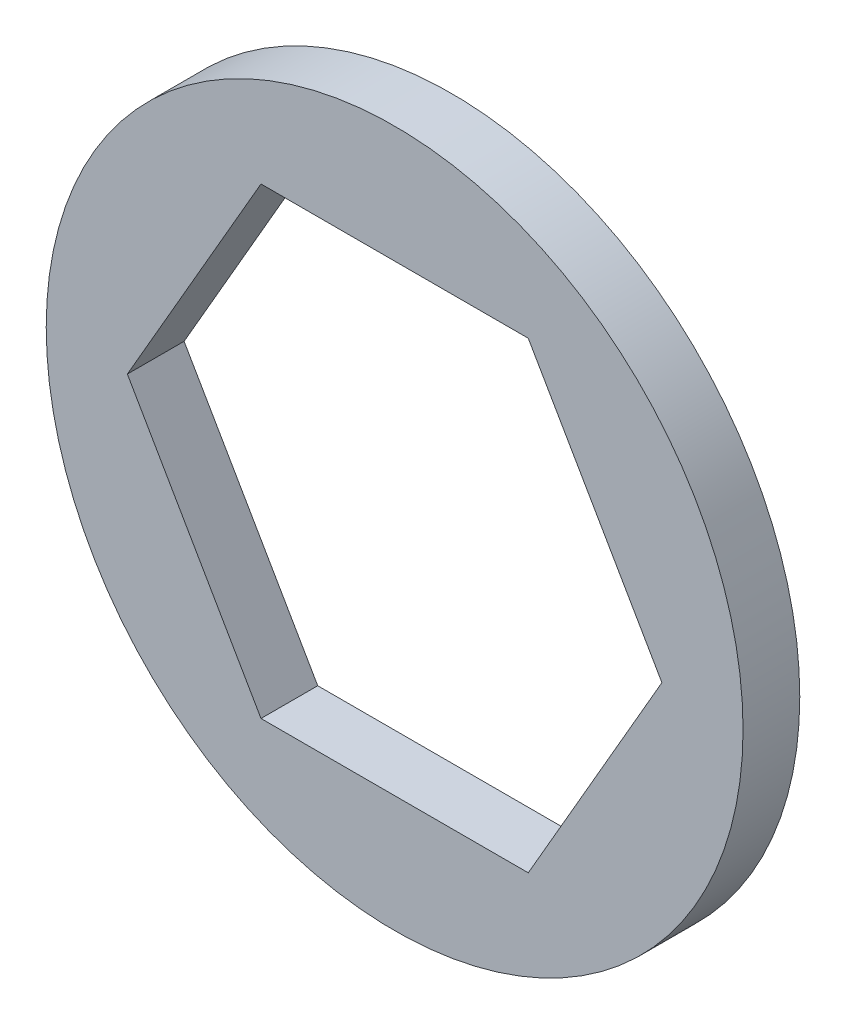
ISO-10303-21;
HEADER;
FILE_DESCRIPTION(('STEP AP214'),'2;1');
FILE_NAME('part.step','',(''),(''),'','','');
FILE_SCHEMA(('AUTOMOTIVE_DESIGN { 1 0 10303 214 1 1 1 1 }'));
ENDSEC;
DATA;
#1=APPLICATION_CONTEXT('core data for automotive mechanical design processes');
#2=APPLICATION_PROTOCOL_DEFINITION('international standard','automotive_design',2000,#1);
#3=PRODUCT_CONTEXT('',#1,'mechanical');
#4=PRODUCT('Part','Part','',(#3));
#5=PRODUCT_RELATED_PRODUCT_CATEGORY('part','',(#4));
#6=PRODUCT_DEFINITION_FORMATION('','',#4);
#7=PRODUCT_DEFINITION_CONTEXT('part definition',#1,'design');
#8=PRODUCT_DEFINITION('design','',#6,#7);
#9=PRODUCT_DEFINITION_SHAPE('','',#8);
#10=(LENGTH_UNIT() NAMED_UNIT(*) SI_UNIT(.MILLI.,.METRE.));
#11=(NAMED_UNIT(*) PLANE_ANGLE_UNIT() SI_UNIT($,.RADIAN.));
#12=(NAMED_UNIT(*) SI_UNIT($,.STERADIAN.) SOLID_ANGLE_UNIT());
#13=UNCERTAINTY_MEASURE_WITH_UNIT(LENGTH_MEASURE(1.E-05),#10,'distance_accuracy_value','');
#14=(GEOMETRIC_REPRESENTATION_CONTEXT(3) GLOBAL_UNCERTAINTY_ASSIGNED_CONTEXT((#13)) GLOBAL_UNIT_ASSIGNED_CONTEXT((#10,
#11,#12)) REPRESENTATION_CONTEXT('',''));
#15=CARTESIAN_POINT('',(0.,0.,0.));
#16=DIRECTION('',(0.,0.,1.));
#17=DIRECTION('',(1.,0.,0.));
#18=AXIS2_PLACEMENT_3D('',#15,#16,#17);
#19=CARTESIAN_POINT('',(0.,0.,0.79375));
#20=DIRECTION('',(0.,0.,1.));
#21=DIRECTION('',(1.,0.,0.));
#22=AXIS2_PLACEMENT_3D('',#19,#20,#21);
#23=PLANE('',#22);
#24=DIRECTION('',(1.,0.,0.));
#25=VECTOR('',#24,1.);
#26=CARTESIAN_POINT('',(3.7394976935412,6.477,0.79375));
#27=LINE('',#26,#25);
#28=CARTESIAN_POINT('',(3.7394976935412,6.477,0.79375));
#29=VERTEX_POINT('',#28);
#30=CARTESIAN_POINT('',(-3.73949769354121,6.477,0.79375));
#31=VERTEX_POINT('',#30);
#32=EDGE_CURVE('E66',#29,#31,#27,.F.);
#33=ORIENTED_EDGE('',*,*,#32,.F.);
#34=DIRECTION('',(0.5,-0.866025403784439,0.));
#35=VECTOR('',#34,1.);
#36=CARTESIAN_POINT('',(7.47899538708241,0.,0.79375));
#37=LINE('',#36,#35);
#38=CARTESIAN_POINT('',(7.47899538708242,0.,0.79375));
#39=VERTEX_POINT('',#38);
#40=EDGE_CURVE('E114',#39,#29,#37,.F.);
#41=ORIENTED_EDGE('',*,*,#40,.F.);
#42=DIRECTION('',(-0.5,-0.866025403784439,0.));
#43=VECTOR('',#42,1.);
#44=CARTESIAN_POINT('',(3.73949769354121,-6.477,0.79375));
#45=LINE('',#44,#43);
#46=CARTESIAN_POINT('',(3.73949769354121,-6.477,0.79375));
#47=VERTEX_POINT('',#46);
#48=EDGE_CURVE('E110',#47,#39,#45,.F.);
#49=ORIENTED_EDGE('',*,*,#48,.F.);
#50=DIRECTION('',(1.,0.,0.));
#51=VECTOR('',#50,1.);
#52=CARTESIAN_POINT('',(-3.73949769354121,-6.477,0.79375));
#53=LINE('',#52,#51);
#54=CARTESIAN_POINT('',(-3.73949769354121,-6.477,0.79375));
#55=VERTEX_POINT('',#54);
#56=EDGE_CURVE('E85',#55,#47,#53,.T.);
#57=ORIENTED_EDGE('',*,*,#56,.F.);
#58=DIRECTION('',(-0.5,0.866025403784439,0.));
#59=VECTOR('',#58,1.);
#60=CARTESIAN_POINT('',(-7.47899538708241,0.,0.79375));
#61=LINE('',#60,#59);
#62=CARTESIAN_POINT('',(-7.47899538708241,0.,0.79375));
#63=VERTEX_POINT('',#62);
#64=EDGE_CURVE('E80',#63,#55,#61,.F.);
#65=ORIENTED_EDGE('',*,*,#64,.F.);
#66=DIRECTION('',(0.5,0.866025403784439,0.));
#67=VECTOR('',#66,1.);
#68=CARTESIAN_POINT('',(-3.73949769354121,6.477,0.79375));
#69=LINE('',#68,#67);
#70=EDGE_CURVE('E71',#31,#63,#69,.F.);
#71=ORIENTED_EDGE('',*,*,#70,.F.);
#72=EDGE_LOOP('',(#33,#41,#49,#57,#65,#71));
#73=FACE_BOUND('',#72,.T.);
#74=CARTESIAN_POINT('',(0.,0.,0.79375));
#75=DIRECTION('',(0.,0.,-1.));
#76=DIRECTION('',(-1.,0.,0.));
#77=AXIS2_PLACEMENT_3D('',#74,#75,#76);
#78=CIRCLE('',#77,9.75);
#79=CARTESIAN_POINT('',(-9.75,0.,0.79375));
#80=VERTEX_POINT('',#79);
#81=EDGE_CURVE('E20',#80,#80,#78,.T.);
#82=ORIENTED_EDGE('',*,*,#81,.F.);
#83=EDGE_LOOP('',(#82));
#84=FACE_BOUND('',#83,.T.);
#85=ADVANCED_FACE('F17',(#73,#84),#23,.T.);
#86=CARTESIAN_POINT('',(0.,0.,0.79375));
#87=DIRECTION('',(0.,0.,-1.));
#88=DIRECTION('',(-1.,0.,0.));
#89=AXIS2_PLACEMENT_3D('',#86,#87,#88);
#90=CYLINDRICAL_SURFACE('',#89,9.75);
#91=ORIENTED_EDGE('',*,*,#81,.T.);
#92=EDGE_LOOP('',(#91));
#93=FACE_BOUND('',#92,.T.);
#94=CARTESIAN_POINT('',(0.,0.,-0.79375));
#95=DIRECTION('',(0.,0.,-1.));
#96=DIRECTION('',(-1.,0.,0.));
#97=AXIS2_PLACEMENT_3D('',#94,#95,#96);
#98=CIRCLE('',#97,9.75);
#99=CARTESIAN_POINT('',(-9.75,0.,-0.79375));
#100=VERTEX_POINT('',#99);
#101=EDGE_CURVE('E96',#100,#100,#98,.F.);
#102=ORIENTED_EDGE('',*,*,#101,.T.);
#103=EDGE_LOOP('',(#102));
#104=FACE_BOUND('',#103,.T.);
#105=ADVANCED_FACE('F190',(#93,#104),#90,.T.);
#106=CARTESIAN_POINT('',(-7.47899538708241,0.,0.79375));
#107=DIRECTION('',(0.866025403784439,0.5,0.));
#108=DIRECTION('',(-0.5,0.866025403784439,0.));
#109=AXIS2_PLACEMENT_3D('',#106,#107,#108);
#110=PLANE('',#109);
#111=ORIENTED_EDGE('',*,*,#64,.T.);
#112=DIRECTION('',(0.,0.,1.));
#113=VECTOR('',#112,1.);
#114=CARTESIAN_POINT('',(-3.73949769354121,-6.477,0.79375));
#115=LINE('',#114,#113);
#116=CARTESIAN_POINT('',(-3.73949769354121,-6.477,-0.79375));
#117=VERTEX_POINT('',#116);
#118=EDGE_CURVE('E103',#117,#55,#115,.T.);
#119=ORIENTED_EDGE('',*,*,#118,.F.);
#120=DIRECTION('',(-0.5,0.866025403784439,0.));
#121=VECTOR('',#120,1.);
#122=CARTESIAN_POINT('',(-3.73949769354121,-6.477,-0.79375));
#123=LINE('',#122,#121);
#124=CARTESIAN_POINT('',(-7.47899538708241,0.,-0.79375));
#125=VERTEX_POINT('',#124);
#126=EDGE_CURVE('E92',#117,#125,#123,.T.);
#127=ORIENTED_EDGE('',*,*,#126,.T.);
#128=DIRECTION('',(0.,0.,1.));
#129=VECTOR('',#128,1.);
#130=CARTESIAN_POINT('',(-7.47899538708241,0.,0.79375));
#131=LINE('',#130,#129);
#132=EDGE_CURVE('E76',#63,#125,#131,.F.);
#133=ORIENTED_EDGE('',*,*,#132,.F.);
#134=EDGE_LOOP('',(#111,#119,#127,#133));
#135=FACE_BOUND('',#134,.T.);
#136=ADVANCED_FACE('F91',(#135),#110,.T.);
#137=CARTESIAN_POINT('',(-3.73949769354121,6.477,0.79375));
#138=DIRECTION('',(0.866025403784439,-0.5,0.));
#139=DIRECTION('',(0.5,0.866025403784439,0.));
#140=AXIS2_PLACEMENT_3D('',#137,#138,#139);
#141=PLANE('',#140);
#142=ORIENTED_EDGE('',*,*,#70,.T.);
#143=ORIENTED_EDGE('',*,*,#132,.T.);
#144=DIRECTION('',(0.5,0.866025403784439,0.));
#145=VECTOR('',#144,1.);
#146=CARTESIAN_POINT('',(-7.47899538708241,0.,-0.79375));
#147=LINE('',#146,#145);
#148=CARTESIAN_POINT('',(-3.73949769354121,6.477,-0.79375));
#149=VERTEX_POINT('',#148);
#150=EDGE_CURVE('E100',#125,#149,#147,.T.);
#151=ORIENTED_EDGE('',*,*,#150,.T.);
#152=DIRECTION('',(0.,0.,1.));
#153=VECTOR('',#152,1.);
#154=CARTESIAN_POINT('',(-3.73949769354121,6.477,0.79375));
#155=LINE('',#154,#153);
#156=EDGE_CURVE('E78',#31,#149,#155,.F.);
#157=ORIENTED_EDGE('',*,*,#156,.F.);
#158=EDGE_LOOP('',(#142,#143,#151,#157));
#159=FACE_BOUND('',#158,.T.);
#160=ADVANCED_FACE('F73',(#159),#141,.T.);
#161=CARTESIAN_POINT('',(3.7394976935412,6.477,0.79375));
#162=DIRECTION('',(0.,-1.,0.));
#163=DIRECTION('',(1.,0.,0.));
#164=AXIS2_PLACEMENT_3D('',#161,#162,#163);
#165=PLANE('',#164);
#166=ORIENTED_EDGE('',*,*,#32,.T.);
#167=ORIENTED_EDGE('',*,*,#156,.T.);
#168=DIRECTION('',(1.,0.,0.));
#169=VECTOR('',#168,1.);
#170=CARTESIAN_POINT('',(0.,6.477,-0.79375));
#171=LINE('',#170,#169);
#172=CARTESIAN_POINT('',(3.7394976935412,6.477,-0.79375));
#173=VERTEX_POINT('',#172);
#174=EDGE_CURVE('E118',#149,#173,#171,.T.);
#175=ORIENTED_EDGE('',*,*,#174,.T.);
#176=DIRECTION('',(0.,0.,1.));
#177=VECTOR('',#176,1.);
#178=CARTESIAN_POINT('',(3.7394976935412,6.47700000000001,0.79375));
#179=LINE('',#178,#177);
#180=EDGE_CURVE('E112',#29,#173,#179,.F.);
#181=ORIENTED_EDGE('',*,*,#180,.F.);
#182=EDGE_LOOP('',(#166,#167,#175,#181));
#183=FACE_BOUND('',#182,.T.);
#184=ADVANCED_FACE('F117',(#183),#165,.T.);
#185=CARTESIAN_POINT('',(7.47899538708241,0.,0.79375));
#186=DIRECTION('',(-0.866025403784439,-0.5,0.));
#187=DIRECTION('',(0.5,-0.866025403784439,0.));
#188=AXIS2_PLACEMENT_3D('',#185,#186,#187);
#189=PLANE('',#188);
#190=ORIENTED_EDGE('',*,*,#40,.T.);
#191=ORIENTED_EDGE('',*,*,#180,.T.);
#192=DIRECTION('',(0.5,-0.866025403784438,0.));
#193=VECTOR('',#192,1.);
#194=CARTESIAN_POINT('',(3.7394976935412,6.477,-0.79375));
#195=LINE('',#194,#193);
#196=CARTESIAN_POINT('',(7.47899538708241,0.,-0.79375));
#197=VERTEX_POINT('',#196);
#198=EDGE_CURVE('E125',#173,#197,#195,.T.);
#199=ORIENTED_EDGE('',*,*,#198,.T.);
#200=DIRECTION('',(0.,0.,1.));
#201=VECTOR('',#200,1.);
#202=CARTESIAN_POINT('',(7.47899538708242,0.,0.79375));
#203=LINE('',#202,#201);
#204=EDGE_CURVE('E108',#39,#197,#203,.F.);
#205=ORIENTED_EDGE('',*,*,#204,.F.);
#206=EDGE_LOOP('',(#190,#191,#199,#205));
#207=FACE_BOUND('',#206,.T.);
#208=ADVANCED_FACE('F134',(#207),#189,.T.);
#209=CARTESIAN_POINT('',(3.73949769354121,-6.477,0.79375));
#210=DIRECTION('',(-0.866025403784439,0.5,0.));
#211=DIRECTION('',(-0.5,-0.866025403784439,0.));
#212=AXIS2_PLACEMENT_3D('',#209,#210,#211);
#213=PLANE('',#212);
#214=ORIENTED_EDGE('',*,*,#48,.T.);
#215=ORIENTED_EDGE('',*,*,#204,.T.);
#216=DIRECTION('',(-0.5,-0.866025403784439,0.));
#217=VECTOR('',#216,1.);
#218=CARTESIAN_POINT('',(7.47899538708241,0.,-0.79375));
#219=LINE('',#218,#217);
#220=CARTESIAN_POINT('',(3.73949769354121,-6.477,-0.79375));
#221=VERTEX_POINT('',#220);
#222=EDGE_CURVE('E26',#197,#221,#219,.T.);
#223=ORIENTED_EDGE('',*,*,#222,.T.);
#224=DIRECTION('',(0.,0.,1.));
#225=VECTOR('',#224,1.);
#226=CARTESIAN_POINT('',(3.73949769354121,-6.477,0.79375));
#227=LINE('',#226,#225);
#228=EDGE_CURVE('E34',#47,#221,#227,.F.);
#229=ORIENTED_EDGE('',*,*,#228,.F.);
#230=EDGE_LOOP('',(#214,#215,#223,#229));
#231=FACE_BOUND('',#230,.T.);
#232=ADVANCED_FACE('F131',(#231),#213,.T.);
#233=CARTESIAN_POINT('',(-3.73949769354121,-6.477,0.79375));
#234=DIRECTION('',(0.,1.,0.));
#235=DIRECTION('',(0.,0.,1.));
#236=AXIS2_PLACEMENT_3D('',#233,#234,#235);
#237=PLANE('',#236);
#238=ORIENTED_EDGE('',*,*,#56,.T.);
#239=ORIENTED_EDGE('',*,*,#228,.T.);
#240=DIRECTION('',(1.,0.,0.));
#241=VECTOR('',#240,1.);
#242=CARTESIAN_POINT('',(0.,-6.477,-0.79375));
#243=LINE('',#242,#241);
#244=EDGE_CURVE('E11',#221,#117,#243,.F.);
#245=ORIENTED_EDGE('',*,*,#244,.T.);
#246=ORIENTED_EDGE('',*,*,#118,.T.);
#247=EDGE_LOOP('',(#238,#239,#245,#246));
#248=FACE_BOUND('',#247,.T.);
#249=ADVANCED_FACE('F143',(#248),#237,.T.);
#250=CARTESIAN_POINT('',(0.,0.,-0.79375));
#251=DIRECTION('',(0.,0.,1.));
#252=DIRECTION('',(1.,0.,0.));
#253=AXIS2_PLACEMENT_3D('',#250,#251,#252);
#254=PLANE('',#253);
#255=ORIENTED_EDGE('',*,*,#222,.F.);
#256=ORIENTED_EDGE('',*,*,#198,.F.);
#257=ORIENTED_EDGE('',*,*,#174,.F.);
#258=ORIENTED_EDGE('',*,*,#150,.F.);
#259=ORIENTED_EDGE('',*,*,#126,.F.);
#260=ORIENTED_EDGE('',*,*,#244,.F.);
#261=EDGE_LOOP('',(#255,#256,#257,#258,#259,#260));
#262=FACE_BOUND('',#261,.T.);
#263=ORIENTED_EDGE('',*,*,#101,.F.);
#264=EDGE_LOOP('',(#263));
#265=FACE_BOUND('',#264,.T.);
#266=ADVANCED_FACE('F122',(#262,#265),#254,.F.);
#267=CLOSED_SHELL('',(#85,#105,#136,#160,#184,#208,#232,#249,#266));
#268=MANIFOLD_SOLID_BREP('B1',#267);
#269=ADVANCED_BREP_SHAPE_REPRESENTATION('',(#18,#268),#14);
#270=SHAPE_DEFINITION_REPRESENTATION(#9,#269);
ENDSEC;
END-ISO-10303-21;
